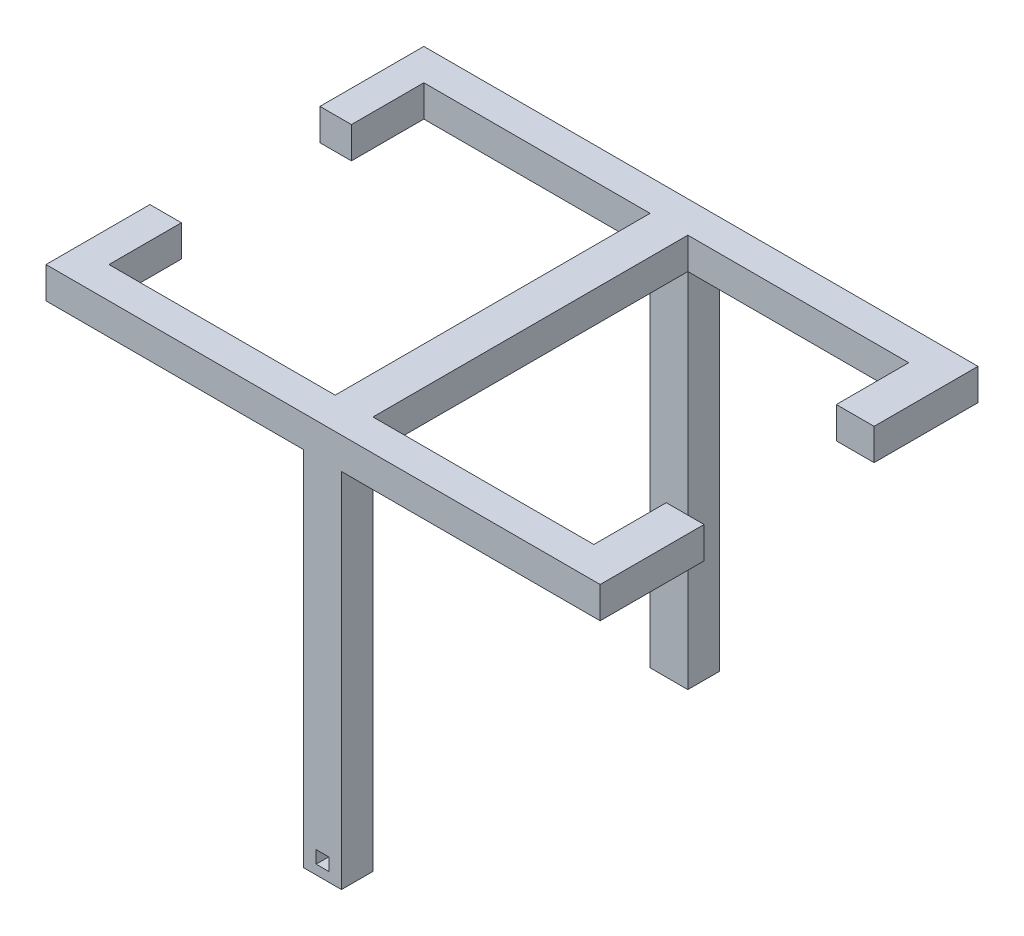
ISO-10303-21;
HEADER;
FILE_DESCRIPTION(('STEP AP214'),'2;1');
FILE_NAME('part.step','',(''),(''),'','','');
FILE_SCHEMA(('AUTOMOTIVE_DESIGN { 1 0 10303 214 1 1 1 1 }'));
ENDSEC;
DATA;
#1=APPLICATION_CONTEXT('core data for automotive mechanical design processes');
#2=APPLICATION_PROTOCOL_DEFINITION('international standard','automotive_design',2000,#1);
#3=PRODUCT_CONTEXT('',#1,'mechanical');
#4=PRODUCT('Part','Part','',(#3));
#5=PRODUCT_RELATED_PRODUCT_CATEGORY('part','',(#4));
#6=PRODUCT_DEFINITION_FORMATION('','',#4);
#7=PRODUCT_DEFINITION_CONTEXT('part definition',#1,'design');
#8=PRODUCT_DEFINITION('design','',#6,#7);
#9=PRODUCT_DEFINITION_SHAPE('','',#8);
#10=(LENGTH_UNIT() NAMED_UNIT(*) SI_UNIT(.MILLI.,.METRE.));
#11=(NAMED_UNIT(*) PLANE_ANGLE_UNIT() SI_UNIT($,.RADIAN.));
#12=(NAMED_UNIT(*) SI_UNIT($,.STERADIAN.) SOLID_ANGLE_UNIT());
#13=UNCERTAINTY_MEASURE_WITH_UNIT(LENGTH_MEASURE(1.E-05),#10,'distance_accuracy_value','');
#14=(GEOMETRIC_REPRESENTATION_CONTEXT(3) GLOBAL_UNCERTAINTY_ASSIGNED_CONTEXT((#13)) GLOBAL_UNIT_ASSIGNED_CONTEXT((#10,
#11,#12)) REPRESENTATION_CONTEXT('',''));
#15=CARTESIAN_POINT('',(0.,0.,0.));
#16=DIRECTION('',(0.,0.,1.));
#17=DIRECTION('',(1.,0.,0.));
#18=AXIS2_PLACEMENT_3D('',#15,#16,#17);
#19=CARTESIAN_POINT('',(0.,0.,10.));
#20=DIRECTION('',(0.,1.,0.));
#21=DIRECTION('',(0.,0.,1.));
#22=AXIS2_PLACEMENT_3D('',#19,#20,#21);
#23=PLANE('',#22);
#24=DIRECTION('',(0.,0.,-1.));
#25=VECTOR('',#24,1.);
#26=CARTESIAN_POINT('',(81.8452588489298,0.,-100.));
#27=LINE('',#26,#25);
#28=CARTESIAN_POINT('',(81.8452588489298,0.,-100.));
#29=VERTEX_POINT('',#28);
#30=CARTESIAN_POINT('',(81.8452588489298,0.,-110.));
#31=VERTEX_POINT('',#30);
#32=EDGE_CURVE('E335',#29,#31,#27,.T.);
#33=ORIENTED_EDGE('',*,*,#32,.F.);
#34=DIRECTION('',(1.,0.,0.));
#35=VECTOR('',#34,1.);
#36=CARTESIAN_POINT('',(0.,0.,-100.));
#37=LINE('',#36,#35);
#38=CARTESIAN_POINT('',(10.,0.,-100.));
#39=VERTEX_POINT('',#38);
#40=EDGE_CURVE('E434',#39,#29,#37,.T.);
#41=ORIENTED_EDGE('',*,*,#40,.F.);
#42=DIRECTION('',(0.,0.,-1.));
#43=VECTOR('',#42,1.);
#44=CARTESIAN_POINT('',(10.,0.,-77.));
#45=LINE('',#44,#43);
#46=CARTESIAN_POINT('',(10.,0.,-77.));
#47=VERTEX_POINT('',#46);
#48=EDGE_CURVE('E408',#47,#39,#45,.T.);
#49=ORIENTED_EDGE('',*,*,#48,.F.);
#50=DIRECTION('',(-1.,0.,0.));
#51=VECTOR('',#50,1.);
#52=CARTESIAN_POINT('',(0.,0.,-77.));
#53=LINE('',#52,#51);
#54=CARTESIAN_POINT('',(0.,0.,-77.));
#55=VERTEX_POINT('',#54);
#56=EDGE_CURVE('E406',#47,#55,#53,.T.);
#57=ORIENTED_EDGE('',*,*,#56,.T.);
#58=DIRECTION('',(0.,0.,1.));
#59=VECTOR('',#58,1.);
#60=CARTESIAN_POINT('',(0.,0.,-110.));
#61=LINE('',#60,#59);
#62=CARTESIAN_POINT('',(0.,0.,-110.));
#63=VERTEX_POINT('',#62);
#64=EDGE_CURVE('E448',#63,#55,#61,.T.);
#65=ORIENTED_EDGE('',*,*,#64,.F.);
#66=DIRECTION('',(1.,0.,0.));
#67=VECTOR('',#66,1.);
#68=CARTESIAN_POINT('',(0.,0.,-110.));
#69=LINE('',#68,#67);
#70=EDGE_CURVE('E426',#63,#31,#69,.T.);
#71=ORIENTED_EDGE('',*,*,#70,.T.);
#72=EDGE_LOOP('',(#33,#41,#49,#57,#65,#71));
#73=FACE_BOUND('',#72,.T.);
#74=ADVANCED_FACE('F33',(#73),#23,.F.);
#75=DIRECTION('',(-1.,0.,0.));
#76=VECTOR('',#75,1.);
#77=CARTESIAN_POINT('',(93.8452588489298,0.,-100.));
#78=LINE('',#77,#76);
#79=CARTESIAN_POINT('',(93.8452588489298,0.,-100.));
#80=VERTEX_POINT('',#79);
#81=EDGE_CURVE('E316',#80,#29,#78,.T.);
#82=ORIENTED_EDGE('',*,*,#81,.F.);
#83=DIRECTION('',(0.,0.,1.));
#84=VECTOR('',#83,1.);
#85=CARTESIAN_POINT('',(93.8452588489298,0.,-50.));
#86=LINE('',#85,#84);
#87=CARTESIAN_POINT('',(93.8452588489298,0.,0.));
#88=VERTEX_POINT('',#87);
#89=EDGE_CURVE('E499',#80,#88,#86,.T.);
#90=ORIENTED_EDGE('',*,*,#89,.T.);
#91=DIRECTION('',(1.,0.,0.));
#92=VECTOR('',#91,1.);
#93=CARTESIAN_POINT('',(93.8452588489298,0.,0.));
#94=LINE('',#93,#92);
#95=CARTESIAN_POINT('',(81.8452588489298,0.,0.));
#96=VERTEX_POINT('',#95);
#97=EDGE_CURVE('E356',#96,#88,#94,.T.);
#98=ORIENTED_EDGE('',*,*,#97,.F.);
#99=DIRECTION('',(0.,0.,1.));
#100=VECTOR('',#99,1.);
#101=CARTESIAN_POINT('',(81.8452588489298,0.,-50.));
#102=LINE('',#101,#100);
#103=EDGE_CURVE('E497',#29,#96,#102,.T.);
#104=ORIENTED_EDGE('',*,*,#103,.F.);
#105=EDGE_LOOP('',(#82,#90,#98,#104));
#106=FACE_BOUND('',#105,.T.);
#107=ADVANCED_FACE('F559',(#106),#23,.F.);
#108=DIRECTION('',(0.,0.,1.));
#109=VECTOR('',#108,1.);
#110=CARTESIAN_POINT('',(93.8452588489298,0.,-100.));
#111=LINE('',#110,#109);
#112=CARTESIAN_POINT('',(93.8452588489298,0.,-110.));
#113=VERTEX_POINT('',#112);
#114=EDGE_CURVE('E326',#113,#80,#111,.T.);
#115=ORIENTED_EDGE('',*,*,#114,.F.);
#116=CARTESIAN_POINT('',(176.,0.,-110.));
#117=VERTEX_POINT('',#116);
#118=EDGE_CURVE('E424',#113,#117,#69,.T.);
#119=ORIENTED_EDGE('',*,*,#118,.T.);
#120=DIRECTION('',(0.,0.,1.));
#121=VECTOR('',#120,1.);
#122=CARTESIAN_POINT('',(176.,0.,-110.));
#123=LINE('',#122,#121);
#124=CARTESIAN_POINT('',(176.,0.,-77.));
#125=VERTEX_POINT('',#124);
#126=EDGE_CURVE('E445',#117,#125,#123,.T.);
#127=ORIENTED_EDGE('',*,*,#126,.T.);
#128=DIRECTION('',(-1.,0.,0.));
#129=VECTOR('',#128,1.);
#130=CARTESIAN_POINT('',(176.,0.,-77.));
#131=LINE('',#130,#129);
#132=CARTESIAN_POINT('',(164.,0.,-77.));
#133=VERTEX_POINT('',#132);
#134=EDGE_CURVE('E384',#125,#133,#131,.T.);
#135=ORIENTED_EDGE('',*,*,#134,.T.);
#136=DIRECTION('',(0.,0.,-1.));
#137=VECTOR('',#136,1.);
#138=CARTESIAN_POINT('',(164.,0.,-77.));
#139=LINE('',#138,#137);
#140=CARTESIAN_POINT('',(164.,0.,-100.));
#141=VERTEX_POINT('',#140);
#142=EDGE_CURVE('E395',#133,#141,#139,.T.);
#143=ORIENTED_EDGE('',*,*,#142,.T.);
#144=EDGE_CURVE('E420',#80,#141,#37,.T.);
#145=ORIENTED_EDGE('',*,*,#144,.F.);
#146=EDGE_LOOP('',(#115,#119,#127,#135,#143,#145));
#147=FACE_BOUND('',#146,.T.);
#148=ADVANCED_FACE('F615',(#147),#23,.F.);
#149=DIRECTION('',(0.,0.,1.));
#150=VECTOR('',#149,1.);
#151=CARTESIAN_POINT('',(93.8452588489298,0.,0.));
#152=LINE('',#151,#150);
#153=CARTESIAN_POINT('',(93.8452588489298,0.,10.));
#154=VERTEX_POINT('',#153);
#155=EDGE_CURVE('E351',#88,#154,#152,.T.);
#156=ORIENTED_EDGE('',*,*,#155,.F.);
#157=DIRECTION('',(1.,0.,0.));
#158=VECTOR('',#157,1.);
#159=CARTESIAN_POINT('',(0.,0.,0.));
#160=LINE('',#159,#158);
#161=CARTESIAN_POINT('',(164.,0.,0.));
#162=VERTEX_POINT('',#161);
#163=EDGE_CURVE('E502',#88,#162,#160,.T.);
#164=ORIENTED_EDGE('',*,*,#163,.T.);
#165=DIRECTION('',(0.,0.,1.));
#166=VECTOR('',#165,1.);
#167=CARTESIAN_POINT('',(164.,0.,-23.));
#168=LINE('',#167,#166);
#169=CARTESIAN_POINT('',(164.,0.,-23.));
#170=VERTEX_POINT('',#169);
#171=EDGE_CURVE('E466',#170,#162,#168,.T.);
#172=ORIENTED_EDGE('',*,*,#171,.F.);
#173=DIRECTION('',(-1.,0.,0.));
#174=VECTOR('',#173,1.);
#175=CARTESIAN_POINT('',(176.,0.,-23.));
#176=LINE('',#175,#174);
#177=CARTESIAN_POINT('',(176.,0.,-23.));
#178=VERTEX_POINT('',#177);
#179=EDGE_CURVE('E455',#178,#170,#176,.T.);
#180=ORIENTED_EDGE('',*,*,#179,.F.);
#181=DIRECTION('',(0.,0.,-1.));
#182=VECTOR('',#181,1.);
#183=CARTESIAN_POINT('',(176.,0.,10.));
#184=LINE('',#183,#182);
#185=CARTESIAN_POINT('',(176.,0.,10.));
#186=VERTEX_POINT('',#185);
#187=EDGE_CURVE('E41',#186,#178,#184,.T.);
#188=ORIENTED_EDGE('',*,*,#187,.F.);
#189=DIRECTION('',(1.,0.,0.));
#190=VECTOR('',#189,1.);
#191=CARTESIAN_POINT('',(0.,0.,10.));
#192=LINE('',#191,#190);
#193=EDGE_CURVE('E506',#154,#186,#192,.T.);
#194=ORIENTED_EDGE('',*,*,#193,.F.);
#195=EDGE_LOOP('',(#156,#164,#172,#180,#188,#194));
#196=FACE_BOUND('',#195,.T.);
#197=ADVANCED_FACE('F532',(#196),#23,.F.);
#198=DIRECTION('',(0.,0.,-1.));
#199=VECTOR('',#198,1.);
#200=CARTESIAN_POINT('',(81.8452588489298,0.,0.));
#201=LINE('',#200,#199);
#202=CARTESIAN_POINT('',(81.8452588489298,0.,10.));
#203=VERTEX_POINT('',#202);
#204=EDGE_CURVE('E365',#203,#96,#201,.T.);
#205=ORIENTED_EDGE('',*,*,#204,.F.);
#206=CARTESIAN_POINT('',(0.,0.,10.));
#207=VERTEX_POINT('',#206);
#208=EDGE_CURVE('E508',#207,#203,#192,.T.);
#209=ORIENTED_EDGE('',*,*,#208,.F.);
#210=DIRECTION('',(0.,0.,-1.));
#211=VECTOR('',#210,1.);
#212=CARTESIAN_POINT('',(0.,0.,10.));
#213=LINE('',#212,#211);
#214=CARTESIAN_POINT('',(0.,0.,-23.));
#215=VERTEX_POINT('',#214);
#216=EDGE_CURVE('E11',#207,#215,#213,.T.);
#217=ORIENTED_EDGE('',*,*,#216,.T.);
#218=DIRECTION('',(-1.,0.,0.));
#219=VECTOR('',#218,1.);
#220=CARTESIAN_POINT('',(0.,0.,-23.));
#221=LINE('',#220,#219);
#222=CARTESIAN_POINT('',(10.,0.,-23.));
#223=VERTEX_POINT('',#222);
#224=EDGE_CURVE('E476',#223,#215,#221,.T.);
#225=ORIENTED_EDGE('',*,*,#224,.F.);
#226=DIRECTION('',(0.,0.,1.));
#227=VECTOR('',#226,1.);
#228=CARTESIAN_POINT('',(10.,0.,-23.));
#229=LINE('',#228,#227);
#230=CARTESIAN_POINT('',(10.,0.,0.));
#231=VERTEX_POINT('',#230);
#232=EDGE_CURVE('E479',#223,#231,#229,.T.);
#233=ORIENTED_EDGE('',*,*,#232,.T.);
#234=EDGE_CURVE('E516',#231,#96,#160,.T.);
#235=ORIENTED_EDGE('',*,*,#234,.T.);
#236=EDGE_LOOP('',(#205,#209,#217,#225,#233,#235));
#237=FACE_BOUND('',#236,.T.);
#238=ADVANCED_FACE('F579',(#237),#23,.F.);
#239=CARTESIAN_POINT('',(0.,0.,0.));
#240=DIRECTION('',(0.,0.,-1.));
#241=DIRECTION('',(-1.,0.,0.));
#242=AXIS2_PLACEMENT_3D('',#239,#240,#241);
#243=PLANE('',#242);
#244=DIRECTION('',(-1.,0.,0.));
#245=VECTOR('',#244,1.);
#246=CARTESIAN_POINT('',(0.,10.,0.));
#247=LINE('',#246,#245);
#248=CARTESIAN_POINT('',(164.,10.,0.));
#249=VERTEX_POINT('',#248);
#250=CARTESIAN_POINT('',(93.8452588489298,10.,0.));
#251=VERTEX_POINT('',#250);
#252=EDGE_CURVE('E507',#249,#251,#247,.T.);
#253=ORIENTED_EDGE('',*,*,#252,.F.);
#254=DIRECTION('',(0.,1.,0.));
#255=VECTOR('',#254,1.);
#256=CARTESIAN_POINT('',(164.,0.,0.));
#257=LINE('',#256,#255);
#258=EDGE_CURVE('E451',#162,#249,#257,.T.);
#259=ORIENTED_EDGE('',*,*,#258,.F.);
#260=ORIENTED_EDGE('',*,*,#163,.F.);
#261=DIRECTION('',(0.,-1.,0.));
#262=VECTOR('',#261,1.);
#263=CARTESIAN_POINT('',(93.8452588489298,10.,0.));
#264=LINE('',#263,#262);
#265=EDGE_CURVE('E485',#251,#88,#264,.T.);
#266=ORIENTED_EDGE('',*,*,#265,.F.);
#267=EDGE_LOOP('',(#253,#259,#260,#266));
#268=FACE_BOUND('',#267,.T.);
#269=ADVANCED_FACE('F555',(#268),#243,.T.);
#270=ORIENTED_EDGE('',*,*,#234,.F.);
#271=DIRECTION('',(0.,-1.,0.));
#272=VECTOR('',#271,1.);
#273=CARTESIAN_POINT('',(10.,0.,0.));
#274=LINE('',#273,#272);
#275=CARTESIAN_POINT('',(10.,10.,0.));
#276=VERTEX_POINT('',#275);
#277=EDGE_CURVE('E468',#276,#231,#274,.T.);
#278=ORIENTED_EDGE('',*,*,#277,.F.);
#279=CARTESIAN_POINT('',(81.8452588489298,10.,0.));
#280=VERTEX_POINT('',#279);
#281=EDGE_CURVE('E519',#280,#276,#247,.T.);
#282=ORIENTED_EDGE('',*,*,#281,.F.);
#283=DIRECTION('',(0.,1.,0.));
#284=VECTOR('',#283,1.);
#285=CARTESIAN_POINT('',(81.8452588489298,10.,0.));
#286=LINE('',#285,#284);
#287=EDGE_CURVE('E488',#96,#280,#286,.T.);
#288=ORIENTED_EDGE('',*,*,#287,.F.);
#289=EDGE_LOOP('',(#270,#278,#282,#288));
#290=FACE_BOUND('',#289,.T.);
#291=ADVANCED_FACE('F586',(#290),#243,.T.);
#292=CARTESIAN_POINT('',(0.,0.,10.));
#293=DIRECTION('',(1.,0.,0.));
#294=DIRECTION('',(0.,0.,-1.));
#295=AXIS2_PLACEMENT_3D('',#292,#293,#294);
#296=PLANE('',#295);
#297=DIRECTION('',(0.,0.,-1.));
#298=VECTOR('',#297,1.);
#299=CARTESIAN_POINT('',(0.,10.,10.));
#300=LINE('',#299,#298);
#301=CARTESIAN_POINT('',(0.,10.,10.));
#302=VERTEX_POINT('',#301);
#303=CARTESIAN_POINT('',(0.,10.,-23.));
#304=VERTEX_POINT('',#303);
#305=EDGE_CURVE('E515',#302,#304,#300,.T.);
#306=ORIENTED_EDGE('',*,*,#305,.T.);
#307=DIRECTION('',(0.,1.,0.));
#308=VECTOR('',#307,1.);
#309=CARTESIAN_POINT('',(0.,0.,-23.));
#310=LINE('',#309,#308);
#311=EDGE_CURVE('E469',#215,#304,#310,.T.);
#312=ORIENTED_EDGE('',*,*,#311,.F.);
#313=ORIENTED_EDGE('',*,*,#216,.F.);
#314=DIRECTION('',(0.,-1.,0.));
#315=VECTOR('',#314,1.);
#316=CARTESIAN_POINT('',(0.,0.,10.));
#317=LINE('',#316,#315);
#318=EDGE_CURVE('E503',#302,#207,#317,.T.);
#319=ORIENTED_EDGE('',*,*,#318,.F.);
#320=EDGE_LOOP('',(#306,#312,#313,#319));
#321=FACE_BOUND('',#320,.T.);
#322=ADVANCED_FACE('F35',(#321),#296,.F.);
#323=CARTESIAN_POINT('',(176.,0.,10.));
#324=DIRECTION('',(-1.,0.,0.));
#325=DIRECTION('',(0.,0.,1.));
#326=AXIS2_PLACEMENT_3D('',#323,#324,#325);
#327=PLANE('',#326);
#328=ORIENTED_EDGE('',*,*,#187,.T.);
#329=DIRECTION('',(0.,-1.,0.));
#330=VECTOR('',#329,1.);
#331=CARTESIAN_POINT('',(176.,0.,-23.));
#332=LINE('',#331,#330);
#333=CARTESIAN_POINT('',(176.,10.,-23.));
#334=VERTEX_POINT('',#333);
#335=EDGE_CURVE('E452',#334,#178,#332,.T.);
#336=ORIENTED_EDGE('',*,*,#335,.F.);
#337=DIRECTION('',(0.,0.,-1.));
#338=VECTOR('',#337,1.);
#339=CARTESIAN_POINT('',(176.,10.,10.));
#340=LINE('',#339,#338);
#341=CARTESIAN_POINT('',(176.,10.,10.));
#342=VERTEX_POINT('',#341);
#343=EDGE_CURVE('E522',#342,#334,#340,.T.);
#344=ORIENTED_EDGE('',*,*,#343,.F.);
#345=DIRECTION('',(0.,1.,0.));
#346=VECTOR('',#345,1.);
#347=CARTESIAN_POINT('',(176.,0.,10.));
#348=LINE('',#347,#346);
#349=EDGE_CURVE('E511',#186,#342,#348,.T.);
#350=ORIENTED_EDGE('',*,*,#349,.F.);
#351=EDGE_LOOP('',(#328,#336,#344,#350));
#352=FACE_BOUND('',#351,.T.);
#353=ADVANCED_FACE('F528',(#352),#327,.F.);
#354=CARTESIAN_POINT('',(0.,10.,10.));
#355=DIRECTION('',(0.,-1.,0.));
#356=DIRECTION('',(0.,0.,-1.));
#357=AXIS2_PLACEMENT_3D('',#354,#355,#356);
#358=PLANE('',#357);
#359=ORIENTED_EDGE('',*,*,#343,.T.);
#360=DIRECTION('',(1.,0.,0.));
#361=VECTOR('',#360,1.);
#362=CARTESIAN_POINT('',(176.,10.,-23.));
#363=LINE('',#362,#361);
#364=CARTESIAN_POINT('',(164.,10.,-23.));
#365=VERTEX_POINT('',#364);
#366=EDGE_CURVE('E459',#365,#334,#363,.T.);
#367=ORIENTED_EDGE('',*,*,#366,.F.);
#368=DIRECTION('',(0.,0.,1.));
#369=VECTOR('',#368,1.);
#370=CARTESIAN_POINT('',(164.,10.,-23.));
#371=LINE('',#370,#369);
#372=EDGE_CURVE('E462',#365,#249,#371,.T.);
#373=ORIENTED_EDGE('',*,*,#372,.T.);
#374=ORIENTED_EDGE('',*,*,#252,.T.);
#375=DIRECTION('',(0.,0.,1.));
#376=VECTOR('',#375,1.);
#377=CARTESIAN_POINT('',(93.8452588489298,10.,-50.));
#378=LINE('',#377,#376);
#379=CARTESIAN_POINT('',(93.8452588489298,10.,-100.));
#380=VERTEX_POINT('',#379);
#381=EDGE_CURVE('E491',#380,#251,#378,.T.);
#382=ORIENTED_EDGE('',*,*,#381,.F.);
#383=DIRECTION('',(-1.,0.,0.));
#384=VECTOR('',#383,1.);
#385=CARTESIAN_POINT('',(0.,10.,-100.));
#386=LINE('',#385,#384);
#387=CARTESIAN_POINT('',(164.,10.,-100.));
#388=VERTEX_POINT('',#387);
#389=EDGE_CURVE('E425',#388,#380,#386,.T.);
#390=ORIENTED_EDGE('',*,*,#389,.F.);
#391=DIRECTION('',(0.,0.,-1.));
#392=VECTOR('',#391,1.);
#393=CARTESIAN_POINT('',(164.,10.,-77.));
#394=LINE('',#393,#392);
#395=CARTESIAN_POINT('',(164.,10.,-77.));
#396=VERTEX_POINT('',#395);
#397=EDGE_CURVE('E391',#396,#388,#394,.T.);
#398=ORIENTED_EDGE('',*,*,#397,.F.);
#399=DIRECTION('',(1.,0.,0.));
#400=VECTOR('',#399,1.);
#401=CARTESIAN_POINT('',(176.,10.,-77.));
#402=LINE('',#401,#400);
#403=CARTESIAN_POINT('',(176.,10.,-77.));
#404=VERTEX_POINT('',#403);
#405=EDGE_CURVE('E389',#396,#404,#402,.T.);
#406=ORIENTED_EDGE('',*,*,#405,.T.);
#407=DIRECTION('',(0.,0.,1.));
#408=VECTOR('',#407,1.);
#409=CARTESIAN_POINT('',(176.,10.,-110.));
#410=LINE('',#409,#408);
#411=CARTESIAN_POINT('',(176.,10.,-110.));
#412=VERTEX_POINT('',#411);
#413=EDGE_CURVE('E442',#412,#404,#410,.T.);
#414=ORIENTED_EDGE('',*,*,#413,.F.);
#415=DIRECTION('',(-1.,0.,0.));
#416=VECTOR('',#415,1.);
#417=CARTESIAN_POINT('',(0.,10.,-110.));
#418=LINE('',#417,#416);
#419=CARTESIAN_POINT('',(0.,10.,-110.));
#420=VERTEX_POINT('',#419);
#421=EDGE_CURVE('E431',#412,#420,#418,.T.);
#422=ORIENTED_EDGE('',*,*,#421,.T.);
#423=DIRECTION('',(0.,0.,1.));
#424=VECTOR('',#423,1.);
#425=CARTESIAN_POINT('',(0.,10.,-110.));
#426=LINE('',#425,#424);
#427=CARTESIAN_POINT('',(0.,10.,-77.));
#428=VERTEX_POINT('',#427);
#429=EDGE_CURVE('E433',#420,#428,#426,.T.);
#430=ORIENTED_EDGE('',*,*,#429,.T.);
#431=DIRECTION('',(1.,0.,0.));
#432=VECTOR('',#431,1.);
#433=CARTESIAN_POINT('',(0.,10.,-77.));
#434=LINE('',#433,#432);
#435=CARTESIAN_POINT('',(10.,10.,-77.));
#436=VERTEX_POINT('',#435);
#437=EDGE_CURVE('E401',#428,#436,#434,.T.);
#438=ORIENTED_EDGE('',*,*,#437,.T.);
#439=DIRECTION('',(0.,0.,-1.));
#440=VECTOR('',#439,1.);
#441=CARTESIAN_POINT('',(10.,10.,-77.));
#442=LINE('',#441,#440);
#443=CARTESIAN_POINT('',(10.,10.,-100.));
#444=VERTEX_POINT('',#443);
#445=EDGE_CURVE('E412',#436,#444,#442,.T.);
#446=ORIENTED_EDGE('',*,*,#445,.T.);
#447=CARTESIAN_POINT('',(81.8452588489298,10.,-100.));
#448=VERTEX_POINT('',#447);
#449=EDGE_CURVE('E437',#448,#444,#386,.T.);
#450=ORIENTED_EDGE('',*,*,#449,.F.);
#451=DIRECTION('',(0.,0.,1.));
#452=VECTOR('',#451,1.);
#453=CARTESIAN_POINT('',(81.8452588489298,10.,-50.));
#454=LINE('',#453,#452);
#455=EDGE_CURVE('E494',#448,#280,#454,.T.);
#456=ORIENTED_EDGE('',*,*,#455,.T.);
#457=ORIENTED_EDGE('',*,*,#281,.T.);
#458=DIRECTION('',(0.,0.,1.));
#459=VECTOR('',#458,1.);
#460=CARTESIAN_POINT('',(10.,10.,-23.));
#461=LINE('',#460,#459);
#462=CARTESIAN_POINT('',(10.,10.,-23.));
#463=VERTEX_POINT('',#462);
#464=EDGE_CURVE('E483',#463,#276,#461,.T.);
#465=ORIENTED_EDGE('',*,*,#464,.F.);
#466=DIRECTION('',(1.,0.,0.));
#467=VECTOR('',#466,1.);
#468=CARTESIAN_POINT('',(0.,10.,-23.));
#469=LINE('',#468,#467);
#470=EDGE_CURVE('E472',#304,#463,#469,.T.);
#471=ORIENTED_EDGE('',*,*,#470,.F.);
#472=ORIENTED_EDGE('',*,*,#305,.F.);
#473=DIRECTION('',(-1.,0.,0.));
#474=VECTOR('',#473,1.);
#475=CARTESIAN_POINT('',(0.,10.,10.));
#476=LINE('',#475,#474);
#477=EDGE_CURVE('E513',#342,#302,#476,.T.);
#478=ORIENTED_EDGE('',*,*,#477,.F.);
#479=EDGE_LOOP('',(#359,#367,#373,#374,#382,#390,#398,#406,#414,#422,#430,#438,#446,#450,#456,
#457,#465,#471,#472,#478));
#480=FACE_BOUND('',#479,.T.);
#481=ADVANCED_FACE('F540',(#480),#358,.F.);
#482=CARTESIAN_POINT('',(0.,0.,10.));
#483=DIRECTION('',(0.,0.,-1.));
#484=DIRECTION('',(-1.,0.,0.));
#485=AXIS2_PLACEMENT_3D('',#482,#483,#484);
#486=PLANE('',#485);
#487=DIRECTION('',(1.,0.,0.));
#488=VECTOR('',#487,1.);
#489=CARTESIAN_POINT('',(89.8030524198394,-112.0228251417,10.));
#490=LINE('',#489,#488);
#491=CARTESIAN_POINT('',(85.8030524198394,-112.0228251417,10.));
#492=VERTEX_POINT('',#491);
#493=CARTESIAN_POINT('',(89.8030524198394,-112.0228251417,10.));
#494=VERTEX_POINT('',#493);
#495=EDGE_CURVE('E306',#492,#494,#490,.T.);
#496=ORIENTED_EDGE('',*,*,#495,.F.);
#497=DIRECTION('',(0.,-1.,0.));
#498=VECTOR('',#497,1.);
#499=CARTESIAN_POINT('',(85.8030524198394,-108.0228251417,10.));
#500=LINE('',#499,#498);
#501=CARTESIAN_POINT('',(85.8030524198394,-108.0228251417,10.));
#502=VERTEX_POINT('',#501);
#503=EDGE_CURVE('E56',#502,#492,#500,.T.);
#504=ORIENTED_EDGE('',*,*,#503,.F.);
#505=DIRECTION('',(-1.,0.,0.));
#506=VECTOR('',#505,1.);
#507=CARTESIAN_POINT('',(89.8030524198394,-108.0228251417,10.));
#508=LINE('',#507,#506);
#509=CARTESIAN_POINT('',(89.8030524198394,-108.0228251417,10.));
#510=VERTEX_POINT('',#509);
#511=EDGE_CURVE('E295',#510,#502,#508,.T.);
#512=ORIENTED_EDGE('',*,*,#511,.F.);
#513=DIRECTION('',(0.,1.,0.));
#514=VECTOR('',#513,1.);
#515=CARTESIAN_POINT('',(89.8030524198394,-108.0228251417,10.));
#516=LINE('',#515,#514);
#517=EDGE_CURVE('E309',#494,#510,#516,.T.);
#518=ORIENTED_EDGE('',*,*,#517,.F.);
#519=EDGE_LOOP('',(#496,#504,#512,#518));
#520=FACE_BOUND('',#519,.T.);
#521=ORIENTED_EDGE('',*,*,#318,.T.);
#522=ORIENTED_EDGE('',*,*,#208,.T.);
#523=DIRECTION('',(0.,1.,0.));
#524=VECTOR('',#523,1.);
#525=CARTESIAN_POINT('',(81.8452588489298,-115.,10.));
#526=LINE('',#525,#524);
#527=CARTESIAN_POINT('',(81.8452588489298,-115.,10.));
#528=VERTEX_POINT('',#527);
#529=EDGE_CURVE('E375',#528,#203,#526,.T.);
#530=ORIENTED_EDGE('',*,*,#529,.F.);
#531=DIRECTION('',(-1.,0.,0.));
#532=VECTOR('',#531,1.);
#533=CARTESIAN_POINT('',(93.8452588489298,-115.,10.));
#534=LINE('',#533,#532);
#535=CARTESIAN_POINT('',(93.8452588489298,-115.,10.));
#536=VERTEX_POINT('',#535);
#537=EDGE_CURVE('E355',#536,#528,#534,.T.);
#538=ORIENTED_EDGE('',*,*,#537,.F.);
#539=DIRECTION('',(0.,1.,0.));
#540=VECTOR('',#539,1.);
#541=CARTESIAN_POINT('',(93.8452588489298,-115.,10.));
#542=LINE('',#541,#540);
#543=EDGE_CURVE('E378',#536,#154,#542,.T.);
#544=ORIENTED_EDGE('',*,*,#543,.T.);
#545=ORIENTED_EDGE('',*,*,#193,.T.);
#546=ORIENTED_EDGE('',*,*,#349,.T.);
#547=ORIENTED_EDGE('',*,*,#477,.T.);
#548=EDGE_LOOP('',(#521,#522,#530,#538,#544,#545,#546,#547));
#549=FACE_BOUND('',#548,.T.);
#550=ADVANCED_FACE('F546',(#520,#549),#486,.F.);
#551=CARTESIAN_POINT('',(93.8452588489298,10.,-50.));
#552=DIRECTION('',(-1.,0.,0.));
#553=DIRECTION('',(0.,0.,1.));
#554=AXIS2_PLACEMENT_3D('',#551,#552,#553);
#555=PLANE('',#554);
#556=ORIENTED_EDGE('',*,*,#265,.T.);
#557=ORIENTED_EDGE('',*,*,#89,.F.);
#558=DIRECTION('',(0.,-1.,0.));
#559=VECTOR('',#558,1.);
#560=CARTESIAN_POINT('',(93.8452588489298,10.,-100.));
#561=LINE('',#560,#559);
#562=EDGE_CURVE('E414',#380,#80,#561,.T.);
#563=ORIENTED_EDGE('',*,*,#562,.F.);
#564=ORIENTED_EDGE('',*,*,#381,.T.);
#565=EDGE_LOOP('',(#556,#557,#563,#564));
#566=FACE_BOUND('',#565,.T.);
#567=ADVANCED_FACE('F564',(#566),#555,.F.);
#568=CARTESIAN_POINT('',(81.8452588489298,10.,-50.));
#569=DIRECTION('',(1.,0.,0.));
#570=DIRECTION('',(0.,0.,-1.));
#571=AXIS2_PLACEMENT_3D('',#568,#569,#570);
#572=PLANE('',#571);
#573=ORIENTED_EDGE('',*,*,#287,.T.);
#574=ORIENTED_EDGE('',*,*,#455,.F.);
#575=DIRECTION('',(0.,1.,0.));
#576=VECTOR('',#575,1.);
#577=CARTESIAN_POINT('',(81.8452588489298,10.,-100.));
#578=LINE('',#577,#576);
#579=EDGE_CURVE('E417',#29,#448,#578,.T.);
#580=ORIENTED_EDGE('',*,*,#579,.F.);
#581=ORIENTED_EDGE('',*,*,#103,.T.);
#582=EDGE_LOOP('',(#573,#574,#580,#581));
#583=FACE_BOUND('',#582,.T.);
#584=ADVANCED_FACE('F589',(#583),#572,.F.);
#585=CARTESIAN_POINT('',(10.,0.,-23.));
#586=DIRECTION('',(-1.,0.,0.));
#587=DIRECTION('',(0.,0.,1.));
#588=AXIS2_PLACEMENT_3D('',#585,#586,#587);
#589=PLANE('',#588);
#590=ORIENTED_EDGE('',*,*,#277,.T.);
#591=ORIENTED_EDGE('',*,*,#232,.F.);
#592=DIRECTION('',(0.,-1.,0.));
#593=VECTOR('',#592,1.);
#594=CARTESIAN_POINT('',(10.,0.,-23.));
#595=LINE('',#594,#593);
#596=EDGE_CURVE('E474',#463,#223,#595,.T.);
#597=ORIENTED_EDGE('',*,*,#596,.F.);
#598=ORIENTED_EDGE('',*,*,#464,.T.);
#599=EDGE_LOOP('',(#590,#591,#597,#598));
#600=FACE_BOUND('',#599,.T.);
#601=ADVANCED_FACE('F744',(#600),#589,.F.);
#602=CARTESIAN_POINT('',(0.,0.,-23.));
#603=DIRECTION('',(0.,0.,-1.));
#604=DIRECTION('',(-1.,0.,0.));
#605=AXIS2_PLACEMENT_3D('',#602,#603,#604);
#606=PLANE('',#605);
#607=ORIENTED_EDGE('',*,*,#311,.T.);
#608=ORIENTED_EDGE('',*,*,#470,.T.);
#609=ORIENTED_EDGE('',*,*,#596,.T.);
#610=ORIENTED_EDGE('',*,*,#224,.T.);
#611=EDGE_LOOP('',(#607,#608,#609,#610));
#612=FACE_BOUND('',#611,.T.);
#613=ADVANCED_FACE('F749',(#612),#606,.T.);
#614=CARTESIAN_POINT('',(164.,0.,-23.));
#615=DIRECTION('',(1.,0.,0.));
#616=DIRECTION('',(0.,0.,-1.));
#617=AXIS2_PLACEMENT_3D('',#614,#615,#616);
#618=PLANE('',#617);
#619=ORIENTED_EDGE('',*,*,#258,.T.);
#620=ORIENTED_EDGE('',*,*,#372,.F.);
#621=DIRECTION('',(0.,1.,0.));
#622=VECTOR('',#621,1.);
#623=CARTESIAN_POINT('',(164.,0.,-23.));
#624=LINE('',#623,#622);
#625=EDGE_CURVE('E457',#170,#365,#624,.T.);
#626=ORIENTED_EDGE('',*,*,#625,.F.);
#627=ORIENTED_EDGE('',*,*,#171,.T.);
#628=EDGE_LOOP('',(#619,#620,#626,#627));
#629=FACE_BOUND('',#628,.T.);
#630=ADVANCED_FACE('F784',(#629),#618,.F.);
#631=CARTESIAN_POINT('',(0.,0.,-23.));
#632=DIRECTION('',(0.,0.,1.));
#633=DIRECTION('',(1.,0.,0.));
#634=AXIS2_PLACEMENT_3D('',#631,#632,#633);
#635=PLANE('',#634);
#636=ORIENTED_EDGE('',*,*,#335,.T.);
#637=ORIENTED_EDGE('',*,*,#179,.T.);
#638=ORIENTED_EDGE('',*,*,#625,.T.);
#639=ORIENTED_EDGE('',*,*,#366,.T.);
#640=EDGE_LOOP('',(#636,#637,#638,#639));
#641=FACE_BOUND('',#640,.T.);
#642=ADVANCED_FACE('F536',(#641),#635,.F.);
#643=CARTESIAN_POINT('',(0.,0.,-100.));
#644=DIRECTION('',(0.,0.,1.));
#645=DIRECTION('',(-1.,0.,0.));
#646=AXIS2_PLACEMENT_3D('',#643,#644,#645);
#647=PLANE('',#646);
#648=ORIENTED_EDGE('',*,*,#389,.T.);
#649=ORIENTED_EDGE('',*,*,#562,.T.);
#650=ORIENTED_EDGE('',*,*,#144,.T.);
#651=DIRECTION('',(0.,1.,0.));
#652=VECTOR('',#651,1.);
#653=CARTESIAN_POINT('',(164.,0.,-100.));
#654=LINE('',#653,#652);
#655=EDGE_CURVE('E381',#141,#388,#654,.T.);
#656=ORIENTED_EDGE('',*,*,#655,.T.);
#657=EDGE_LOOP('',(#648,#649,#650,#656));
#658=FACE_BOUND('',#657,.T.);
#659=ADVANCED_FACE('F621',(#658),#647,.T.);
#660=ORIENTED_EDGE('',*,*,#40,.T.);
#661=ORIENTED_EDGE('',*,*,#579,.T.);
#662=ORIENTED_EDGE('',*,*,#449,.T.);
#663=DIRECTION('',(0.,-1.,0.));
#664=VECTOR('',#663,1.);
#665=CARTESIAN_POINT('',(10.,0.,-100.));
#666=LINE('',#665,#664);
#667=EDGE_CURVE('E397',#444,#39,#666,.T.);
#668=ORIENTED_EDGE('',*,*,#667,.T.);
#669=EDGE_LOOP('',(#660,#661,#662,#668));
#670=FACE_BOUND('',#669,.T.);
#671=ADVANCED_FACE('F597',(#670),#647,.T.);
#672=CARTESIAN_POINT('',(0.,0.,-110.));
#673=DIRECTION('',(1.,0.,0.));
#674=DIRECTION('',(0.,0.,1.));
#675=AXIS2_PLACEMENT_3D('',#672,#673,#674);
#676=PLANE('',#675);
#677=ORIENTED_EDGE('',*,*,#429,.F.);
#678=DIRECTION('',(0.,-1.,0.));
#679=VECTOR('',#678,1.);
#680=CARTESIAN_POINT('',(0.,0.,-110.));
#681=LINE('',#680,#679);
#682=EDGE_CURVE('E421',#420,#63,#681,.T.);
#683=ORIENTED_EDGE('',*,*,#682,.T.);
#684=ORIENTED_EDGE('',*,*,#64,.T.);
#685=DIRECTION('',(0.,1.,0.));
#686=VECTOR('',#685,1.);
#687=CARTESIAN_POINT('',(0.,0.,-77.));
#688=LINE('',#687,#686);
#689=EDGE_CURVE('E398',#55,#428,#688,.T.);
#690=ORIENTED_EDGE('',*,*,#689,.T.);
#691=EDGE_LOOP('',(#677,#683,#684,#690));
#692=FACE_BOUND('',#691,.T.);
#693=ADVANCED_FACE('F641',(#692),#676,.F.);
#694=CARTESIAN_POINT('',(176.,0.,-110.));
#695=DIRECTION('',(-1.,0.,0.));
#696=DIRECTION('',(0.,0.,-1.));
#697=AXIS2_PLACEMENT_3D('',#694,#695,#696);
#698=PLANE('',#697);
#699=ORIENTED_EDGE('',*,*,#126,.F.);
#700=DIRECTION('',(0.,1.,0.));
#701=VECTOR('',#700,1.);
#702=CARTESIAN_POINT('',(176.,0.,-110.));
#703=LINE('',#702,#701);
#704=EDGE_CURVE('E428',#117,#412,#703,.T.);
#705=ORIENTED_EDGE('',*,*,#704,.T.);
#706=ORIENTED_EDGE('',*,*,#413,.T.);
#707=DIRECTION('',(0.,-1.,0.));
#708=VECTOR('',#707,1.);
#709=CARTESIAN_POINT('',(176.,0.,-77.));
#710=LINE('',#709,#708);
#711=EDGE_CURVE('E382',#404,#125,#710,.T.);
#712=ORIENTED_EDGE('',*,*,#711,.T.);
#713=EDGE_LOOP('',(#699,#705,#706,#712));
#714=FACE_BOUND('',#713,.T.);
#715=ADVANCED_FACE('F634',(#714),#698,.F.);
#716=CARTESIAN_POINT('',(0.,0.,-110.));
#717=DIRECTION('',(0.,0.,1.));
#718=DIRECTION('',(-1.,0.,0.));
#719=AXIS2_PLACEMENT_3D('',#716,#717,#718);
#720=PLANE('',#719);
#721=DIRECTION('',(-1.,0.,0.));
#722=VECTOR('',#721,1.);
#723=CARTESIAN_POINT('',(85.8452588489298,-112.,-110.));
#724=LINE('',#723,#722);
#725=CARTESIAN_POINT('',(89.8452588489298,-112.,-110.));
#726=VERTEX_POINT('',#725);
#727=CARTESIAN_POINT('',(85.8452588489298,-112.,-110.));
#728=VERTEX_POINT('',#727);
#729=EDGE_CURVE('E282',#726,#728,#724,.T.);
#730=ORIENTED_EDGE('',*,*,#729,.F.);
#731=DIRECTION('',(0.,-1.,0.));
#732=VECTOR('',#731,1.);
#733=CARTESIAN_POINT('',(89.8452588489298,-108.,-110.));
#734=LINE('',#733,#732);
#735=CARTESIAN_POINT('',(89.8452588489298,-108.,-110.));
#736=VERTEX_POINT('',#735);
#737=EDGE_CURVE('E48',#736,#726,#734,.T.);
#738=ORIENTED_EDGE('',*,*,#737,.F.);
#739=DIRECTION('',(1.,0.,0.));
#740=VECTOR('',#739,1.);
#741=CARTESIAN_POINT('',(85.8452588489298,-108.,-110.));
#742=LINE('',#741,#740);
#743=CARTESIAN_POINT('',(85.8452588489298,-108.,-110.));
#744=VERTEX_POINT('',#743);
#745=EDGE_CURVE('E273',#744,#736,#742,.T.);
#746=ORIENTED_EDGE('',*,*,#745,.F.);
#747=DIRECTION('',(0.,1.,0.));
#748=VECTOR('',#747,1.);
#749=CARTESIAN_POINT('',(85.8452588489298,-108.,-110.));
#750=LINE('',#749,#748);
#751=EDGE_CURVE('E276',#728,#744,#750,.T.);
#752=ORIENTED_EDGE('',*,*,#751,.F.);
#753=EDGE_LOOP('',(#730,#738,#746,#752));
#754=FACE_BOUND('',#753,.T.);
#755=ORIENTED_EDGE('',*,*,#682,.F.);
#756=ORIENTED_EDGE('',*,*,#421,.F.);
#757=ORIENTED_EDGE('',*,*,#704,.F.);
#758=ORIENTED_EDGE('',*,*,#118,.F.);
#759=DIRECTION('',(0.,1.,0.));
#760=VECTOR('',#759,1.);
#761=CARTESIAN_POINT('',(93.8452588489298,-115.,-110.));
#762=LINE('',#761,#760);
#763=CARTESIAN_POINT('',(93.8452588489298,-115.,-110.));
#764=VERTEX_POINT('',#763);
#765=EDGE_CURVE('E342',#764,#113,#762,.T.);
#766=ORIENTED_EDGE('',*,*,#765,.F.);
#767=DIRECTION('',(1.,0.,0.));
#768=VECTOR('',#767,1.);
#769=CARTESIAN_POINT('',(93.8452588489298,-115.,-110.));
#770=LINE('',#769,#768);
#771=CARTESIAN_POINT('',(81.8452588489298,-115.,-110.));
#772=VERTEX_POINT('',#771);
#773=EDGE_CURVE('E328',#772,#764,#770,.T.);
#774=ORIENTED_EDGE('',*,*,#773,.F.);
#775=DIRECTION('',(0.,1.,0.));
#776=VECTOR('',#775,1.);
#777=CARTESIAN_POINT('',(81.8452588489298,-115.,-110.));
#778=LINE('',#777,#776);
#779=EDGE_CURVE('E345',#772,#31,#778,.T.);
#780=ORIENTED_EDGE('',*,*,#779,.T.);
#781=ORIENTED_EDGE('',*,*,#70,.F.);
#782=EDGE_LOOP('',(#755,#756,#757,#758,#766,#774,#780,#781));
#783=FACE_BOUND('',#782,.T.);
#784=ADVANCED_FACE('F638',(#754,#783),#720,.F.);
#785=CARTESIAN_POINT('',(10.,0.,-77.));
#786=DIRECTION('',(-1.,0.,0.));
#787=DIRECTION('',(0.,0.,-1.));
#788=AXIS2_PLACEMENT_3D('',#785,#786,#787);
#789=PLANE('',#788);
#790=ORIENTED_EDGE('',*,*,#667,.F.);
#791=ORIENTED_EDGE('',*,*,#445,.F.);
#792=DIRECTION('',(0.,-1.,0.));
#793=VECTOR('',#792,1.);
#794=CARTESIAN_POINT('',(10.,0.,-77.));
#795=LINE('',#794,#793);
#796=EDGE_CURVE('E404',#436,#47,#795,.T.);
#797=ORIENTED_EDGE('',*,*,#796,.T.);
#798=ORIENTED_EDGE('',*,*,#48,.T.);
#799=EDGE_LOOP('',(#790,#791,#797,#798));
#800=FACE_BOUND('',#799,.T.);
#801=ADVANCED_FACE('F647',(#800),#789,.F.);
#802=CARTESIAN_POINT('',(0.,0.,-77.));
#803=DIRECTION('',(0.,0.,1.));
#804=DIRECTION('',(-1.,0.,0.));
#805=AXIS2_PLACEMENT_3D('',#802,#803,#804);
#806=PLANE('',#805);
#807=ORIENTED_EDGE('',*,*,#689,.F.);
#808=ORIENTED_EDGE('',*,*,#56,.F.);
#809=ORIENTED_EDGE('',*,*,#796,.F.);
#810=ORIENTED_EDGE('',*,*,#437,.F.);
#811=EDGE_LOOP('',(#807,#808,#809,#810));
#812=FACE_BOUND('',#811,.T.);
#813=ADVANCED_FACE('F645',(#812),#806,.T.);
#814=CARTESIAN_POINT('',(164.,0.,-77.));
#815=DIRECTION('',(1.,0.,0.));
#816=DIRECTION('',(0.,0.,1.));
#817=AXIS2_PLACEMENT_3D('',#814,#815,#816);
#818=PLANE('',#817);
#819=ORIENTED_EDGE('',*,*,#655,.F.);
#820=ORIENTED_EDGE('',*,*,#142,.F.);
#821=DIRECTION('',(0.,1.,0.));
#822=VECTOR('',#821,1.);
#823=CARTESIAN_POINT('',(164.,0.,-77.));
#824=LINE('',#823,#822);
#825=EDGE_CURVE('E387',#133,#396,#824,.T.);
#826=ORIENTED_EDGE('',*,*,#825,.T.);
#827=ORIENTED_EDGE('',*,*,#397,.T.);
#828=EDGE_LOOP('',(#819,#820,#826,#827));
#829=FACE_BOUND('',#828,.T.);
#830=ADVANCED_FACE('F628',(#829),#818,.F.);
#831=CARTESIAN_POINT('',(0.,0.,-77.));
#832=DIRECTION('',(0.,0.,-1.));
#833=DIRECTION('',(1.,0.,0.));
#834=AXIS2_PLACEMENT_3D('',#831,#832,#833);
#835=PLANE('',#834);
#836=ORIENTED_EDGE('',*,*,#711,.F.);
#837=ORIENTED_EDGE('',*,*,#405,.F.);
#838=ORIENTED_EDGE('',*,*,#825,.F.);
#839=ORIENTED_EDGE('',*,*,#134,.F.);
#840=EDGE_LOOP('',(#836,#837,#838,#839));
#841=FACE_BOUND('',#840,.T.);
#842=ADVANCED_FACE('F631',(#841),#835,.F.);
#843=CARTESIAN_POINT('',(93.8452588489298,-115.,0.));
#844=DIRECTION('',(-1.,0.,0.));
#845=DIRECTION('',(0.,0.,1.));
#846=AXIS2_PLACEMENT_3D('',#843,#844,#845);
#847=PLANE('',#846);
#848=ORIENTED_EDGE('',*,*,#155,.T.);
#849=ORIENTED_EDGE('',*,*,#543,.F.);
#850=DIRECTION('',(0.,0.,1.));
#851=VECTOR('',#850,1.);
#852=CARTESIAN_POINT('',(93.8452588489298,-115.,0.));
#853=LINE('',#852,#851);
#854=CARTESIAN_POINT('',(93.8452588489298,-115.,0.));
#855=VERTEX_POINT('',#854);
#856=EDGE_CURVE('E352',#855,#536,#853,.T.);
#857=ORIENTED_EDGE('',*,*,#856,.F.);
#858=DIRECTION('',(0.,1.,0.));
#859=VECTOR('',#858,1.);
#860=CARTESIAN_POINT('',(93.8452588489298,-115.,0.));
#861=LINE('',#860,#859);
#862=EDGE_CURVE('E362',#855,#88,#861,.T.);
#863=ORIENTED_EDGE('',*,*,#862,.T.);
#864=EDGE_LOOP('',(#848,#849,#857,#863));
#865=FACE_BOUND('',#864,.T.);
#866=ADVANCED_FACE('F571',(#865),#847,.F.);
#867=CARTESIAN_POINT('',(81.8452588489298,-115.,0.));
#868=DIRECTION('',(1.,0.,0.));
#869=DIRECTION('',(0.,0.,-1.));
#870=AXIS2_PLACEMENT_3D('',#867,#868,#869);
#871=PLANE('',#870);
#872=ORIENTED_EDGE('',*,*,#204,.T.);
#873=DIRECTION('',(0.,1.,0.));
#874=VECTOR('',#873,1.);
#875=CARTESIAN_POINT('',(81.8452588489298,-115.,0.));
#876=LINE('',#875,#874);
#877=CARTESIAN_POINT('',(81.8452588489298,-115.,0.));
#878=VERTEX_POINT('',#877);
#879=EDGE_CURVE('E372',#878,#96,#876,.T.);
#880=ORIENTED_EDGE('',*,*,#879,.F.);
#881=DIRECTION('',(0.,0.,-1.));
#882=VECTOR('',#881,1.);
#883=CARTESIAN_POINT('',(81.8452588489298,-115.,0.));
#884=LINE('',#883,#882);
#885=EDGE_CURVE('E358',#528,#878,#884,.T.);
#886=ORIENTED_EDGE('',*,*,#885,.F.);
#887=ORIENTED_EDGE('',*,*,#529,.T.);
#888=EDGE_LOOP('',(#872,#880,#886,#887));
#889=FACE_BOUND('',#888,.T.);
#890=ADVANCED_FACE('F577',(#889),#871,.F.);
#891=CARTESIAN_POINT('',(93.8452588489298,-115.,0.));
#892=DIRECTION('',(0.,0.,1.));
#893=DIRECTION('',(1.,0.,0.));
#894=AXIS2_PLACEMENT_3D('',#891,#892,#893);
#895=PLANE('',#894);
#896=ORIENTED_EDGE('',*,*,#97,.T.);
#897=ORIENTED_EDGE('',*,*,#862,.F.);
#898=DIRECTION('',(1.,0.,0.));
#899=VECTOR('',#898,1.);
#900=CARTESIAN_POINT('',(93.8452588489298,-115.,0.));
#901=LINE('',#900,#899);
#902=EDGE_CURVE('E360',#878,#855,#901,.T.);
#903=ORIENTED_EDGE('',*,*,#902,.F.);
#904=ORIENTED_EDGE('',*,*,#879,.T.);
#905=EDGE_LOOP('',(#896,#897,#903,#904));
#906=FACE_BOUND('',#905,.T.);
#907=ADVANCED_FACE('F567',(#906),#895,.F.);
#908=CARTESIAN_POINT('',(0.,-115.,0.));
#909=DIRECTION('',(0.,-1.,0.));
#910=DIRECTION('',(0.,0.,-1.));
#911=AXIS2_PLACEMENT_3D('',#908,#909,#910);
#912=PLANE('',#911);
#913=ORIENTED_EDGE('',*,*,#856,.T.);
#914=ORIENTED_EDGE('',*,*,#537,.T.);
#915=ORIENTED_EDGE('',*,*,#885,.T.);
#916=ORIENTED_EDGE('',*,*,#902,.T.);
#917=EDGE_LOOP('',(#913,#914,#915,#916));
#918=FACE_BOUND('',#917,.T.);
#919=ADVANCED_FACE('F573',(#918),#912,.T.);
#920=CARTESIAN_POINT('',(93.8452588489298,-115.,-100.));
#921=DIRECTION('',(0.,0.,-1.));
#922=DIRECTION('',(-1.,0.,0.));
#923=AXIS2_PLACEMENT_3D('',#920,#921,#922);
#924=PLANE('',#923);
#925=ORIENTED_EDGE('',*,*,#81,.T.);
#926=DIRECTION('',(0.,1.,0.));
#927=VECTOR('',#926,1.);
#928=CARTESIAN_POINT('',(81.8452588489298,-115.,-100.));
#929=LINE('',#928,#927);
#930=CARTESIAN_POINT('',(81.8452588489298,-115.,-100.));
#931=VERTEX_POINT('',#930);
#932=EDGE_CURVE('E348',#931,#29,#929,.T.);
#933=ORIENTED_EDGE('',*,*,#932,.F.);
#934=DIRECTION('',(-1.,0.,0.));
#935=VECTOR('',#934,1.);
#936=CARTESIAN_POINT('',(93.8452588489298,-115.,-100.));
#937=LINE('',#936,#935);
#938=CARTESIAN_POINT('',(93.8452588489298,-115.,-100.));
#939=VERTEX_POINT('',#938);
#940=EDGE_CURVE('E322',#939,#931,#937,.T.);
#941=ORIENTED_EDGE('',*,*,#940,.F.);
#942=DIRECTION('',(0.,1.,0.));
#943=VECTOR('',#942,1.);
#944=CARTESIAN_POINT('',(93.8452588489298,-115.,-100.));
#945=LINE('',#944,#943);
#946=EDGE_CURVE('E332',#939,#80,#945,.T.);
#947=ORIENTED_EDGE('',*,*,#946,.T.);
#948=EDGE_LOOP('',(#925,#933,#941,#947));
#949=FACE_BOUND('',#948,.T.);
#950=ADVANCED_FACE('F607',(#949),#924,.F.);
#951=CARTESIAN_POINT('',(81.8452588489298,-115.,-100.));
#952=DIRECTION('',(1.,0.,0.));
#953=DIRECTION('',(0.,0.,-1.));
#954=AXIS2_PLACEMENT_3D('',#951,#952,#953);
#955=PLANE('',#954);
#956=ORIENTED_EDGE('',*,*,#32,.T.);
#957=ORIENTED_EDGE('',*,*,#779,.F.);
#958=DIRECTION('',(0.,0.,-1.));
#959=VECTOR('',#958,1.);
#960=CARTESIAN_POINT('',(81.8452588489298,-115.,-100.));
#961=LINE('',#960,#959);
#962=EDGE_CURVE('E325',#931,#772,#961,.T.);
#963=ORIENTED_EDGE('',*,*,#962,.F.);
#964=ORIENTED_EDGE('',*,*,#932,.T.);
#965=EDGE_LOOP('',(#956,#957,#963,#964));
#966=FACE_BOUND('',#965,.T.);
#967=ADVANCED_FACE('F603',(#966),#955,.F.);
#968=CARTESIAN_POINT('',(93.8452588489298,-115.,-100.));
#969=DIRECTION('',(-1.,0.,0.));
#970=DIRECTION('',(0.,0.,1.));
#971=AXIS2_PLACEMENT_3D('',#968,#969,#970);
#972=PLANE('',#971);
#973=ORIENTED_EDGE('',*,*,#114,.T.);
#974=ORIENTED_EDGE('',*,*,#946,.F.);
#975=DIRECTION('',(0.,0.,1.));
#976=VECTOR('',#975,1.);
#977=CARTESIAN_POINT('',(93.8452588489298,-115.,-100.));
#978=LINE('',#977,#976);
#979=EDGE_CURVE('E330',#764,#939,#978,.T.);
#980=ORIENTED_EDGE('',*,*,#979,.F.);
#981=ORIENTED_EDGE('',*,*,#765,.T.);
#982=EDGE_LOOP('',(#973,#974,#980,#981));
#983=FACE_BOUND('',#982,.T.);
#984=ADVANCED_FACE('F611',(#983),#972,.F.);
#985=CARTESIAN_POINT('',(0.,-115.,0.));
#986=DIRECTION('',(0.,-1.,0.));
#987=DIRECTION('',(0.,0.,-1.));
#988=AXIS2_PLACEMENT_3D('',#985,#986,#987);
#989=PLANE('',#988);
#990=ORIENTED_EDGE('',*,*,#940,.T.);
#991=ORIENTED_EDGE('',*,*,#962,.T.);
#992=ORIENTED_EDGE('',*,*,#773,.T.);
#993=ORIENTED_EDGE('',*,*,#979,.T.);
#994=EDGE_LOOP('',(#990,#991,#992,#993));
#995=FACE_BOUND('',#994,.T.);
#996=ADVANCED_FACE('F872',(#995),#989,.T.);
#997=CARTESIAN_POINT('',(85.8030524198394,-108.0228251417,5.));
#998=DIRECTION('',(-1.,0.,0.));
#999=DIRECTION('',(0.,0.,1.));
#1000=AXIS2_PLACEMENT_3D('',#997,#998,#999);
#1001=PLANE('',#1000);
#1002=ORIENTED_EDGE('',*,*,#503,.T.);
#1003=DIRECTION('',(0.,0.,1.));
#1004=VECTOR('',#1003,1.);
#1005=CARTESIAN_POINT('',(85.8030524198394,-112.0228251417,5.));
#1006=LINE('',#1005,#1004);
#1007=CARTESIAN_POINT('',(85.8030524198394,-112.0228251417,5.));
#1008=VERTEX_POINT('',#1007);
#1009=EDGE_CURVE('E304',#1008,#492,#1006,.T.);
#1010=ORIENTED_EDGE('',*,*,#1009,.F.);
#1011=DIRECTION('',(0.,-1.,0.));
#1012=VECTOR('',#1011,1.);
#1013=CARTESIAN_POINT('',(85.8030524198394,-108.0228251417,5.));
#1014=LINE('',#1013,#1012);
#1015=CARTESIAN_POINT('',(85.8030524198394,-108.0228251417,5.));
#1016=VERTEX_POINT('',#1015);
#1017=EDGE_CURVE('E291',#1016,#1008,#1014,.T.);
#1018=ORIENTED_EDGE('',*,*,#1017,.F.);
#1019=DIRECTION('',(0.,0.,1.));
#1020=VECTOR('',#1019,1.);
#1021=CARTESIAN_POINT('',(85.8030524198394,-108.0228251417,5.));
#1022=LINE('',#1021,#1020);
#1023=EDGE_CURVE('E314',#1016,#502,#1022,.T.);
#1024=ORIENTED_EDGE('',*,*,#1023,.T.);
#1025=EDGE_LOOP('',(#1002,#1010,#1018,#1024));
#1026=FACE_BOUND('',#1025,.T.);
#1027=ADVANCED_FACE('F881',(#1026),#1001,.F.);
#1028=CARTESIAN_POINT('',(89.8030524198394,-108.0228251417,5.));
#1029=DIRECTION('',(0.,1.,0.));
#1030=DIRECTION('',(0.,0.,1.));
#1031=AXIS2_PLACEMENT_3D('',#1028,#1029,#1030);
#1032=PLANE('',#1031);
#1033=ORIENTED_EDGE('',*,*,#511,.T.);
#1034=ORIENTED_EDGE('',*,*,#1023,.F.);
#1035=DIRECTION('',(-1.,0.,0.));
#1036=VECTOR('',#1035,1.);
#1037=CARTESIAN_POINT('',(89.8030524198394,-108.0228251417,5.));
#1038=LINE('',#1037,#1036);
#1039=CARTESIAN_POINT('',(89.8030524198394,-108.0228251417,5.));
#1040=VERTEX_POINT('',#1039);
#1041=EDGE_CURVE('E301',#1040,#1016,#1038,.T.);
#1042=ORIENTED_EDGE('',*,*,#1041,.F.);
#1043=DIRECTION('',(0.,0.,1.));
#1044=VECTOR('',#1043,1.);
#1045=CARTESIAN_POINT('',(89.8030524198394,-108.0228251417,5.));
#1046=LINE('',#1045,#1044);
#1047=EDGE_CURVE('E317',#1040,#510,#1046,.T.);
#1048=ORIENTED_EDGE('',*,*,#1047,.T.);
#1049=EDGE_LOOP('',(#1033,#1034,#1042,#1048));
#1050=FACE_BOUND('',#1049,.T.);
#1051=ADVANCED_FACE('F899',(#1050),#1032,.F.);
#1052=CARTESIAN_POINT('',(89.8030524198394,-108.0228251417,5.));
#1053=DIRECTION('',(1.,0.,0.));
#1054=DIRECTION('',(0.,0.,-1.));
#1055=AXIS2_PLACEMENT_3D('',#1052,#1053,#1054);
#1056=PLANE('',#1055);
#1057=ORIENTED_EDGE('',*,*,#517,.T.);
#1058=ORIENTED_EDGE('',*,*,#1047,.F.);
#1059=DIRECTION('',(0.,1.,0.));
#1060=VECTOR('',#1059,1.);
#1061=CARTESIAN_POINT('',(89.8030524198394,-108.0228251417,5.));
#1062=LINE('',#1061,#1060);
#1063=CARTESIAN_POINT('',(89.8030524198394,-112.0228251417,5.));
#1064=VERTEX_POINT('',#1063);
#1065=EDGE_CURVE('E298',#1064,#1040,#1062,.T.);
#1066=ORIENTED_EDGE('',*,*,#1065,.F.);
#1067=DIRECTION('',(0.,0.,1.));
#1068=VECTOR('',#1067,1.);
#1069=CARTESIAN_POINT('',(89.8030524198394,-112.0228251417,5.));
#1070=LINE('',#1069,#1068);
#1071=EDGE_CURVE('E319',#1064,#494,#1070,.T.);
#1072=ORIENTED_EDGE('',*,*,#1071,.T.);
#1073=EDGE_LOOP('',(#1057,#1058,#1066,#1072));
#1074=FACE_BOUND('',#1073,.T.);
#1075=ADVANCED_FACE('F908',(#1074),#1056,.F.);
#1076=CARTESIAN_POINT('',(89.8030524198394,-112.0228251417,5.));
#1077=DIRECTION('',(0.,-1.,0.));
#1078=DIRECTION('',(0.,0.,-1.));
#1079=AXIS2_PLACEMENT_3D('',#1076,#1077,#1078);
#1080=PLANE('',#1079);
#1081=ORIENTED_EDGE('',*,*,#495,.T.);
#1082=ORIENTED_EDGE('',*,*,#1071,.F.);
#1083=DIRECTION('',(1.,0.,0.));
#1084=VECTOR('',#1083,1.);
#1085=CARTESIAN_POINT('',(89.8030524198394,-112.0228251417,5.));
#1086=LINE('',#1085,#1084);
#1087=EDGE_CURVE('E294',#1008,#1064,#1086,.T.);
#1088=ORIENTED_EDGE('',*,*,#1087,.F.);
#1089=ORIENTED_EDGE('',*,*,#1009,.T.);
#1090=EDGE_LOOP('',(#1081,#1082,#1088,#1089));
#1091=FACE_BOUND('',#1090,.T.);
#1092=ADVANCED_FACE('F918',(#1091),#1080,.F.);
#1093=CARTESIAN_POINT('',(0.,0.,5.));
#1094=DIRECTION('',(0.,0.,-1.));
#1095=DIRECTION('',(-1.,0.,0.));
#1096=AXIS2_PLACEMENT_3D('',#1093,#1094,#1095);
#1097=PLANE('',#1096);
#1098=ORIENTED_EDGE('',*,*,#1017,.T.);
#1099=ORIENTED_EDGE('',*,*,#1087,.T.);
#1100=ORIENTED_EDGE('',*,*,#1065,.T.);
#1101=ORIENTED_EDGE('',*,*,#1041,.T.);
#1102=EDGE_LOOP('',(#1098,#1099,#1100,#1101));
#1103=FACE_BOUND('',#1102,.T.);
#1104=ADVANCED_FACE('F928',(#1103),#1097,.F.);
#1105=CARTESIAN_POINT('',(89.8452588489298,-108.,-105.));
#1106=DIRECTION('',(1.,0.,0.));
#1107=DIRECTION('',(0.,0.,-1.));
#1108=AXIS2_PLACEMENT_3D('',#1105,#1106,#1107);
#1109=PLANE('',#1108);
#1110=ORIENTED_EDGE('',*,*,#737,.T.);
#1111=DIRECTION('',(0.,0.,-1.));
#1112=VECTOR('',#1111,1.);
#1113=CARTESIAN_POINT('',(89.8452588489298,-112.,-105.));
#1114=LINE('',#1113,#1112);
#1115=CARTESIAN_POINT('',(89.8452588489298,-112.,-105.));
#1116=VERTEX_POINT('',#1115);
#1117=EDGE_CURVE('E251',#1116,#726,#1114,.T.);
#1118=ORIENTED_EDGE('',*,*,#1117,.F.);
#1119=DIRECTION('',(0.,-1.,0.));
#1120=VECTOR('',#1119,1.);
#1121=CARTESIAN_POINT('',(89.8452588489298,-108.,-105.));
#1122=LINE('',#1121,#1120);
#1123=CARTESIAN_POINT('',(89.8452588489298,-108.,-105.));
#1124=VERTEX_POINT('',#1123);
#1125=EDGE_CURVE('E255',#1124,#1116,#1122,.T.);
#1126=ORIENTED_EDGE('',*,*,#1125,.F.);
#1127=DIRECTION('',(0.,0.,-1.));
#1128=VECTOR('',#1127,1.);
#1129=CARTESIAN_POINT('',(89.8452588489298,-108.,-105.));
#1130=LINE('',#1129,#1128);
#1131=EDGE_CURVE('E286',#1124,#736,#1130,.T.);
#1132=ORIENTED_EDGE('',*,*,#1131,.T.);
#1133=EDGE_LOOP('',(#1110,#1118,#1126,#1132));
#1134=FACE_BOUND('',#1133,.T.);
#1135=ADVANCED_FACE('F253',(#1134),#1109,.F.);
#1136=CARTESIAN_POINT('',(85.8452588489298,-108.,-105.));
#1137=DIRECTION('',(0.,1.,0.));
#1138=DIRECTION('',(0.,0.,1.));
#1139=AXIS2_PLACEMENT_3D('',#1136,#1137,#1138);
#1140=PLANE('',#1139);
#1141=ORIENTED_EDGE('',*,*,#745,.T.);
#1142=ORIENTED_EDGE('',*,*,#1131,.F.);
#1143=DIRECTION('',(1.,0.,0.));
#1144=VECTOR('',#1143,1.);
#1145=CARTESIAN_POINT('',(85.8452588489298,-108.,-105.));
#1146=LINE('',#1145,#1144);
#1147=CARTESIAN_POINT('',(85.8452588489298,-108.,-105.));
#1148=VERTEX_POINT('',#1147);
#1149=EDGE_CURVE('E261',#1148,#1124,#1146,.T.);
#1150=ORIENTED_EDGE('',*,*,#1149,.F.);
#1151=DIRECTION('',(0.,0.,-1.));
#1152=VECTOR('',#1151,1.);
#1153=CARTESIAN_POINT('',(85.8452588489298,-108.,-105.));
#1154=LINE('',#1153,#1152);
#1155=EDGE_CURVE('E288',#1148,#744,#1154,.T.);
#1156=ORIENTED_EDGE('',*,*,#1155,.T.);
#1157=EDGE_LOOP('',(#1141,#1142,#1150,#1156));
#1158=FACE_BOUND('',#1157,.T.);
#1159=ADVANCED_FACE('F954',(#1158),#1140,.F.);
#1160=CARTESIAN_POINT('',(85.8452588489298,-108.,-105.));
#1161=DIRECTION('',(-1.,0.,0.));
#1162=DIRECTION('',(0.,0.,1.));
#1163=AXIS2_PLACEMENT_3D('',#1160,#1161,#1162);
#1164=PLANE('',#1163);
#1165=ORIENTED_EDGE('',*,*,#751,.T.);
#1166=ORIENTED_EDGE('',*,*,#1155,.F.);
#1167=DIRECTION('',(0.,1.,0.));
#1168=VECTOR('',#1167,1.);
#1169=CARTESIAN_POINT('',(85.8452588489298,-108.,-105.));
#1170=LINE('',#1169,#1168);
#1171=CARTESIAN_POINT('',(85.8452588489298,-112.,-105.));
#1172=VERTEX_POINT('',#1171);
#1173=EDGE_CURVE('E269',#1172,#1148,#1170,.T.);
#1174=ORIENTED_EDGE('',*,*,#1173,.F.);
#1175=DIRECTION('',(0.,0.,-1.));
#1176=VECTOR('',#1175,1.);
#1177=CARTESIAN_POINT('',(85.8452588489298,-112.,-105.));
#1178=LINE('',#1177,#1176);
#1179=EDGE_CURVE('E260',#1172,#728,#1178,.T.);
#1180=ORIENTED_EDGE('',*,*,#1179,.T.);
#1181=EDGE_LOOP('',(#1165,#1166,#1174,#1180));
#1182=FACE_BOUND('',#1181,.T.);
#1183=ADVANCED_FACE('F963',(#1182),#1164,.F.);
#1184=CARTESIAN_POINT('',(85.8452588489298,-112.,-105.));
#1185=DIRECTION('',(0.,-1.,0.));
#1186=DIRECTION('',(0.,0.,-1.));
#1187=AXIS2_PLACEMENT_3D('',#1184,#1185,#1186);
#1188=PLANE('',#1187);
#1189=ORIENTED_EDGE('',*,*,#729,.T.);
#1190=ORIENTED_EDGE('',*,*,#1179,.F.);
#1191=DIRECTION('',(-1.,0.,0.));
#1192=VECTOR('',#1191,1.);
#1193=CARTESIAN_POINT('',(85.8452588489298,-112.,-105.));
#1194=LINE('',#1193,#1192);
#1195=EDGE_CURVE('E264',#1116,#1172,#1194,.T.);
#1196=ORIENTED_EDGE('',*,*,#1195,.F.);
#1197=ORIENTED_EDGE('',*,*,#1117,.T.);
#1198=EDGE_LOOP('',(#1189,#1190,#1196,#1197));
#1199=FACE_BOUND('',#1198,.T.);
#1200=ADVANCED_FACE('F265',(#1199),#1188,.F.);
#1201=CARTESIAN_POINT('',(0.,0.,-105.));
#1202=DIRECTION('',(0.,0.,1.));
#1203=DIRECTION('',(1.,0.,0.));
#1204=AXIS2_PLACEMENT_3D('',#1201,#1202,#1203);
#1205=PLANE('',#1204);
#1206=ORIENTED_EDGE('',*,*,#1125,.T.);
#1207=ORIENTED_EDGE('',*,*,#1195,.T.);
#1208=ORIENTED_EDGE('',*,*,#1173,.T.);
#1209=ORIENTED_EDGE('',*,*,#1149,.T.);
#1210=EDGE_LOOP('',(#1206,#1207,#1208,#1209));
#1211=FACE_BOUND('',#1210,.T.);
#1212=ADVANCED_FACE('F271',(#1211),#1205,.F.);
#1213=CLOSED_SHELL('',(#74,#107,#148,#197,#238,#269,#291,#322,#353,#481,#550,#567,#584,#601,
#613,#630,#642,#659,#671,#693,#715,#784,#801,#813,#830,#842,#866,#890,#907,#919,#950,#967,#984,
#996,#1027,#1051,#1075,#1092,#1104,#1135,#1159,#1183,#1200,#1212));
#1214=MANIFOLD_SOLID_BREP('B2',#1213);
#1215=ADVANCED_BREP_SHAPE_REPRESENTATION('',(#18,#1214),#14);
#1216=SHAPE_DEFINITION_REPRESENTATION(#9,#1215);
ENDSEC;
END-ISO-10303-21;
